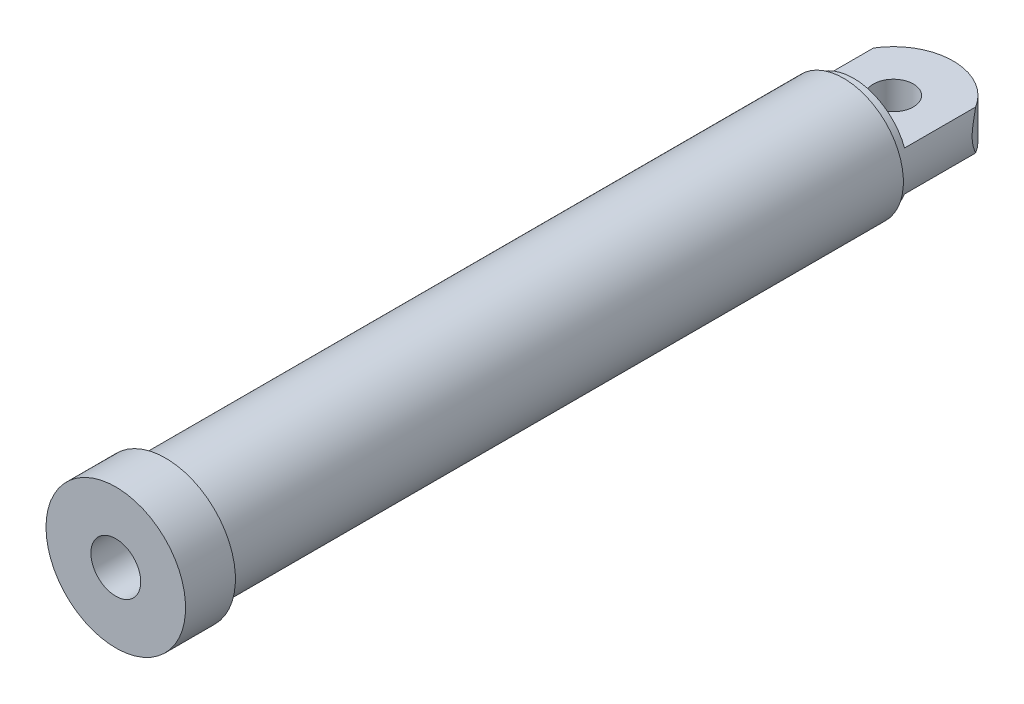
ISO-10303-21;
HEADER;
FILE_DESCRIPTION(('STEP AP214'),'2;1');
FILE_NAME('part.step','',(''),(''),'','','');
FILE_SCHEMA(('AUTOMOTIVE_DESIGN { 1 0 10303 214 1 1 1 1 }'));
ENDSEC;
DATA;
#1=APPLICATION_CONTEXT('core data for automotive mechanical design processes');
#2=APPLICATION_PROTOCOL_DEFINITION('international standard','automotive_design',2000,#1);
#3=PRODUCT_CONTEXT('',#1,'mechanical');
#4=PRODUCT('Part','Part','',(#3));
#5=PRODUCT_RELATED_PRODUCT_CATEGORY('part','',(#4));
#6=PRODUCT_DEFINITION_FORMATION('','',#4);
#7=PRODUCT_DEFINITION_CONTEXT('part definition',#1,'design');
#8=PRODUCT_DEFINITION('design','',#6,#7);
#9=PRODUCT_DEFINITION_SHAPE('','',#8);
#10=(LENGTH_UNIT() NAMED_UNIT(*) SI_UNIT(.MILLI.,.METRE.));
#11=(NAMED_UNIT(*) PLANE_ANGLE_UNIT() SI_UNIT($,.RADIAN.));
#12=(NAMED_UNIT(*) SI_UNIT($,.STERADIAN.) SOLID_ANGLE_UNIT());
#13=UNCERTAINTY_MEASURE_WITH_UNIT(LENGTH_MEASURE(1.E-05),#10,'distance_accuracy_value','');
#14=(GEOMETRIC_REPRESENTATION_CONTEXT(3) GLOBAL_UNCERTAINTY_ASSIGNED_CONTEXT((#13)) GLOBAL_UNIT_ASSIGNED_CONTEXT((#10,
#11,#12)) REPRESENTATION_CONTEXT('',''));
#15=CARTESIAN_POINT('',(0.,0.,0.));
#16=DIRECTION('',(0.,0.,1.));
#17=DIRECTION('',(1.,0.,0.));
#18=AXIS2_PLACEMENT_3D('',#15,#16,#17);
#19=CARTESIAN_POINT('',(0.,0.,0.));
#20=DIRECTION('',(0.,0.,-1.));
#21=DIRECTION('',(-1.,0.,0.));
#22=AXIS2_PLACEMENT_3D('',#19,#20,#21);
#23=CYLINDRICAL_SURFACE('',#22,60.);
#24=CARTESIAN_POINT('',(0.,0.,730.));
#25=DIRECTION('',(0.,0.,-1.));
#26=DIRECTION('',(-1.,0.,0.));
#27=AXIS2_PLACEMENT_3D('',#24,#25,#26);
#28=CIRCLE('',#27,60.);
#29=CARTESIAN_POINT('',(-59.9999999999999,0.,730.));
#30=VERTEX_POINT('',#29);
#31=EDGE_CURVE('E103',#30,#30,#28,.T.);
#32=ORIENTED_EDGE('',*,*,#31,.T.);
#33=EDGE_LOOP('',(#32));
#34=FACE_BOUND('',#33,.T.);
#35=CARTESIAN_POINT('',(0.,0.,50.));
#36=DIRECTION('',(0.,0.,-1.));
#37=DIRECTION('',(-1.,0.,0.));
#38=AXIS2_PLACEMENT_3D('',#35,#36,#37);
#39=CIRCLE('',#38,60.);
#40=CARTESIAN_POINT('',(-60.,0.,50.));
#41=VERTEX_POINT('',#40);
#42=EDGE_CURVE('E46',#41,#41,#39,.T.);
#43=ORIENTED_EDGE('',*,*,#42,.F.);
#44=EDGE_LOOP('',(#43));
#45=FACE_BOUND('',#44,.T.);
#46=ADVANCED_FACE('F43',(#34,#45),#23,.T.);
#47=CARTESIAN_POINT('',(45.0000000000001,0.,60.));
#48=DIRECTION('',(0.,0.,-1.));
#49=DIRECTION('',(-1.,0.,0.));
#50=AXIS2_PLACEMENT_3D('',#47,#48,#49);
#51=PLANE('',#50);
#52=CARTESIAN_POINT('',(0.,0.,60.));
#53=DIRECTION('',(0.,0.,-1.));
#54=DIRECTION('',(-1.,0.,0.));
#55=AXIS2_PLACEMENT_3D('',#52,#53,#54);
#56=CIRCLE('',#55,45.0000000000001);
#57=CARTESIAN_POINT('',(-45.0000000000001,0.,60.));
#58=VERTEX_POINT('',#57);
#59=EDGE_CURVE('E138',#58,#58,#56,.T.);
#60=ORIENTED_EDGE('',*,*,#59,.F.);
#61=EDGE_LOOP('',(#60));
#62=FACE_BOUND('',#61,.T.);
#63=ADVANCED_FACE('F180',(#62),#51,.F.);
#64=CARTESIAN_POINT('',(0.,0.,0.));
#65=DIRECTION('',(0.,0.,-1.));
#66=DIRECTION('',(-1.,0.,0.));
#67=AXIS2_PLACEMENT_3D('',#64,#65,#66);
#68=CYLINDRICAL_SURFACE('',#67,45.0000000000001);
#69=CARTESIAN_POINT('',(0.,0.,700.));
#70=DIRECTION('',(0.,0.,-1.));
#71=DIRECTION('',(-1.,0.,0.));
#72=AXIS2_PLACEMENT_3D('',#69,#70,#71);
#73=CIRCLE('',#72,45.);
#74=CARTESIAN_POINT('',(-45.,0.,700.));
#75=VERTEX_POINT('',#74);
#76=EDGE_CURVE('E134',#75,#75,#73,.T.);
#77=ORIENTED_EDGE('',*,*,#76,.F.);
#78=EDGE_LOOP('',(#77));
#79=FACE_BOUND('',#78,.T.);
#80=ORIENTED_EDGE('',*,*,#59,.T.);
#81=EDGE_LOOP('',(#80));
#82=FACE_BOUND('',#81,.T.);
#83=ADVANCED_FACE('F185',(#79,#82),#68,.F.);
#84=CARTESIAN_POINT('',(25.0000000000001,0.,700.));
#85=DIRECTION('',(0.,0.,1.));
#86=DIRECTION('',(1.,0.,0.));
#87=AXIS2_PLACEMENT_3D('',#84,#85,#86);
#88=PLANE('',#87);
#89=CARTESIAN_POINT('',(0.,0.,700.));
#90=DIRECTION('',(0.,0.,-1.));
#91=DIRECTION('',(-1.,0.,0.));
#92=AXIS2_PLACEMENT_3D('',#89,#90,#91);
#93=CIRCLE('',#92,25.);
#94=CARTESIAN_POINT('',(-25.,0.,700.));
#95=VERTEX_POINT('',#94);
#96=EDGE_CURVE('E130',#95,#95,#93,.T.);
#97=ORIENTED_EDGE('',*,*,#96,.F.);
#98=EDGE_LOOP('',(#97));
#99=FACE_BOUND('',#98,.T.);
#100=ORIENTED_EDGE('',*,*,#76,.T.);
#101=EDGE_LOOP('',(#100));
#102=FACE_BOUND('',#101,.T.);
#103=ADVANCED_FACE('F232',(#99,#102),#88,.F.);
#104=CARTESIAN_POINT('',(0.,0.,0.));
#105=DIRECTION('',(0.,0.,-1.));
#106=DIRECTION('',(-1.,0.,0.));
#107=AXIS2_PLACEMENT_3D('',#104,#105,#106);
#108=CYLINDRICAL_SURFACE('',#107,25.);
#109=CARTESIAN_POINT('',(0.,0.,780.));
#110=DIRECTION('',(0.,0.,-1.));
#111=DIRECTION('',(-1.,0.,0.));
#112=AXIS2_PLACEMENT_3D('',#109,#110,#111);
#113=CIRCLE('',#112,25.);
#114=CARTESIAN_POINT('',(-24.9999999999999,0.,780.));
#115=VERTEX_POINT('',#114);
#116=EDGE_CURVE('E126',#115,#115,#113,.T.);
#117=ORIENTED_EDGE('',*,*,#116,.F.);
#118=EDGE_LOOP('',(#117));
#119=FACE_BOUND('',#118,.T.);
#120=ORIENTED_EDGE('',*,*,#96,.T.);
#121=EDGE_LOOP('',(#120));
#122=FACE_BOUND('',#121,.T.);
#123=ADVANCED_FACE('F236',(#119,#122),#108,.F.);
#124=CARTESIAN_POINT('',(70.,0.,780.));
#125=DIRECTION('',(0.,0.,-1.));
#126=DIRECTION('',(-1.,0.,0.));
#127=AXIS2_PLACEMENT_3D('',#124,#125,#126);
#128=PLANE('',#127);
#129=CARTESIAN_POINT('',(0.,0.,780.));
#130=DIRECTION('',(0.,0.,-1.));
#131=DIRECTION('',(-1.,0.,0.));
#132=AXIS2_PLACEMENT_3D('',#129,#130,#131);
#133=CIRCLE('',#132,70.);
#134=CARTESIAN_POINT('',(-69.9999999999999,0.,780.));
#135=VERTEX_POINT('',#134);
#136=EDGE_CURVE('E122',#135,#135,#133,.T.);
#137=ORIENTED_EDGE('',*,*,#136,.F.);
#138=EDGE_LOOP('',(#137));
#139=FACE_BOUND('',#138,.T.);
#140=ORIENTED_EDGE('',*,*,#116,.T.);
#141=EDGE_LOOP('',(#140));
#142=FACE_BOUND('',#141,.T.);
#143=ADVANCED_FACE('F240',(#139,#142),#128,.F.);
#144=CARTESIAN_POINT('',(0.,0.,0.));
#145=DIRECTION('',(0.,0.,-1.));
#146=DIRECTION('',(-1.,0.,0.));
#147=AXIS2_PLACEMENT_3D('',#144,#145,#146);
#148=CYLINDRICAL_SURFACE('',#147,70.);
#149=CARTESIAN_POINT('',(0.,0.,730.));
#150=DIRECTION('',(0.,0.,-1.));
#151=DIRECTION('',(-1.,0.,0.));
#152=AXIS2_PLACEMENT_3D('',#149,#150,#151);
#153=CIRCLE('',#152,70.);
#154=CARTESIAN_POINT('',(-69.9999999999999,0.,730.));
#155=VERTEX_POINT('',#154);
#156=EDGE_CURVE('E109',#155,#155,#153,.T.);
#157=ORIENTED_EDGE('',*,*,#156,.F.);
#158=EDGE_LOOP('',(#157));
#159=FACE_BOUND('',#158,.T.);
#160=ORIENTED_EDGE('',*,*,#136,.T.);
#161=EDGE_LOOP('',(#160));
#162=FACE_BOUND('',#161,.T.);
#163=ADVANCED_FACE('F244',(#159,#162),#148,.T.);
#164=CARTESIAN_POINT('',(70.0000000000001,0.,730.));
#165=DIRECTION('',(0.,0.,1.));
#166=DIRECTION('',(1.,0.,0.));
#167=AXIS2_PLACEMENT_3D('',#164,#165,#166);
#168=PLANE('',#167);
#169=ORIENTED_EDGE('',*,*,#31,.F.);
#170=EDGE_LOOP('',(#169));
#171=FACE_BOUND('',#170,.T.);
#172=ORIENTED_EDGE('',*,*,#156,.T.);
#173=EDGE_LOOP('',(#172));
#174=FACE_BOUND('',#173,.T.);
#175=ADVANCED_FACE('F163',(#171,#174),#168,.F.);
#176=CARTESIAN_POINT('',(0.,0.,50.));
#177=DIRECTION('',(0.,0.,-1.));
#178=DIRECTION('',(-1.,0.,0.));
#179=AXIS2_PLACEMENT_3D('',#176,#177,#178);
#180=PLANE('',#179);
#181=CARTESIAN_POINT('',(0.,0.,50.));
#182=DIRECTION('',(0.,0.,-1.));
#183=DIRECTION('',(-1.,0.,0.));
#184=AXIS2_PLACEMENT_3D('',#181,#182,#183);
#185=CIRCLE('',#184,55.);
#186=CARTESIAN_POINT('',(-55.,0.,50.));
#187=VERTEX_POINT('',#186);
#188=EDGE_CURVE('E215',#187,#187,#185,.T.);
#189=ORIENTED_EDGE('',*,*,#188,.F.);
#190=EDGE_LOOP('',(#189));
#191=FACE_BOUND('',#190,.T.);
#192=ORIENTED_EDGE('',*,*,#42,.T.);
#193=EDGE_LOOP('',(#192));
#194=FACE_BOUND('',#193,.T.);
#195=ADVANCED_FACE('F158',(#191,#194),#180,.T.);
#196=CARTESIAN_POINT('',(0.,0.,50.));
#197=DIRECTION('',(0.,0.,-1.));
#198=DIRECTION('',(-1.,0.,0.));
#199=AXIS2_PLACEMENT_3D('',#196,#197,#198);
#200=CYLINDRICAL_SURFACE('',#199,55.);
#201=ORIENTED_EDGE('',*,*,#188,.T.);
#202=EDGE_LOOP('',(#201));
#203=FACE_BOUND('',#202,.T.);
#204=CARTESIAN_POINT('',(-51.234753829798,20.,-31.2249899919919));
#205=CARTESIAN_POINT('',(-51.3712103418228,19.6504237364978,-31.0010938328795));
#206=CARTESIAN_POINT('',(-51.5045010722681,19.2984175196761,-30.7790780288577));
#207=CARTESIAN_POINT('',(-51.7646776284598,18.5892682173008,-30.3394685057058));
#208=CARTESIAN_POINT('',(-51.8915628826439,18.2321246769833,-30.1218751822258));
#209=CARTESIAN_POINT('',(-52.2627851917116,17.1517340394822,-29.4762232921029));
#210=CARTESIAN_POINT('',(-52.4973346402981,16.4204317204274,-29.0558766833022));
#211=CARTESIAN_POINT('',(-52.9438002271502,14.9191174032238,-28.2343246571702));
#212=CARTESIAN_POINT('',(-53.1551453959298,14.148616962826,-27.8336977894913));
#213=CARTESIAN_POINT('',(-53.5476985578258,12.5815736915443,-27.0707928493247));
#214=CARTESIAN_POINT('',(-53.7289198957763,11.7850425803651,-26.7084978218561));
#215=CARTESIAN_POINT('',(-54.0320486449519,10.2964403032531,-26.0890146093488));
#216=CARTESIAN_POINT('',(-54.1588093516962,9.60850208399527,-25.824319564569));
#217=CARTESIAN_POINT('',(-54.3878807602413,8.21328418298736,-25.3383236994417));
#218=CARTESIAN_POINT('',(-54.4901915331757,7.50600455751513,-25.1170227528453));
#219=CARTESIAN_POINT('',(-54.6676594152826,6.079414602545,-24.728373986342));
#220=CARTESIAN_POINT('',(-54.7430277551137,5.36024628748654,-24.560607619583));
#221=CARTESIAN_POINT('',(-54.8658161359943,3.90805134142374,-24.2850814531454));
#222=CARTESIAN_POINT('',(-54.9132396611083,3.17502644977659,-24.1773141730769));
#223=CARTESIAN_POINT('',(-54.9790922993348,1.69071815352413,-24.0272020410826));
#224=CARTESIAN_POINT('',(-54.9971160006449,0.939322146177825,-23.9857720949582));
#225=CARTESIAN_POINT('',(-55.0022441114968,-0.564122307132695,-23.974010795699));
#226=CARTESIAN_POINT('',(-54.9893491524318,-1.31617073946016,-24.0036779906824));
#227=CARTESIAN_POINT('',(-54.933030345018,-2.81547449110806,-24.1322803420913));
#228=CARTESIAN_POINT('',(-54.8895092852759,-3.56270688150815,-24.2314360603559));
#229=CARTESIAN_POINT('',(-54.7732967602278,-5.04362627676651,-24.4929825623701));
#230=CARTESIAN_POINT('',(-54.7005991865704,-5.7773104115164,-24.6553865874797));
#231=CARTESIAN_POINT('',(-54.5055023316134,-7.41600648368185,-25.0842378146332));
#232=CARTESIAN_POINT('',(-54.3750869446152,-8.31582405094968,-25.366770913127));
#233=CARTESIAN_POINT('',(-54.0750770237305,-10.0842285671677,-26.0001633436826));
#234=CARTESIAN_POINT('',(-53.905463062673,-10.9527997826453,-26.3510565420488));
#235=CARTESIAN_POINT('',(-53.5300769735132,-12.6608560434831,-27.1055121659923));
#236=CARTESIAN_POINT('',(-53.3242218928405,-13.5002689540104,-27.5091948645809));
#237=CARTESIAN_POINT('',(-52.8792385885377,-15.1497743587683,-28.3551495939166));
#238=CARTESIAN_POINT('',(-52.6401204697679,-15.9598756636414,-28.7974098901525));
#239=CARTESIAN_POINT('',(-52.207951260875,-17.3109334351971,-29.5713066295323));
#240=CARTESIAN_POINT('',(-52.0230363606781,-17.8587485796701,-29.8956334935264));
#241=CARTESIAN_POINT('',(-51.639340122877,-18.9395084157563,-30.5536154642438));
#242=CARTESIAN_POINT('',(-51.4406371557238,-19.4725163514551,-30.8872122757043));
#243=CARTESIAN_POINT('',(-51.234753829798,-20.,-31.2249899919919));
#244=B_SPLINE_CURVE_WITH_KNOTS('',3,(#204,#205,#206,#207,#208,#209,#210,#211,#212,#213,#214,
#215,#216,#217,#218,#219,#220,#221,#222,#223,#224,#225,#226,#227,#228,#229,#230,#231,#232,#233,
#234,#235,#236,#237,#238,#239,#240,#241,#242,#243),.UNSPECIFIED.,.F.,.F.,(4,2,2,2,2,2,2,2,2,2,2,
2,2,2,2,2,2,2,2,4),(0.,1.31090200495055,2.62192077599482,5.24735611740963,7.92729682701593,
10.6060471425754,12.84821496436,15.0903762627869,17.3145520049003,19.5384503856338,
21.7927638622824,24.0470313037586,26.3084865603976,28.570415519115,31.4219764528141,
34.2749536884494,37.1345481013978,39.9932756977515,41.981735899764,43.9596969653085),.UNSPECIFIED.);
#245=CARTESIAN_POINT('',(-51.234753829798,20.,-31.2249899919919));
#246=VERTEX_POINT('',#245);
#247=CARTESIAN_POINT('',(-51.234753829798,-20.,-31.2249899919919));
#248=VERTEX_POINT('',#247);
#249=EDGE_CURVE('E11',#246,#248,#244,.T.);
#250=ORIENTED_EDGE('',*,*,#249,.T.);
#251=DIRECTION('',(0.,0.,-1.));
#252=VECTOR('',#251,1.);
#253=CARTESIAN_POINT('',(-51.234753829798,-20.,50.));
#254=LINE('',#253,#252);
#255=CARTESIAN_POINT('',(-51.234753829798,-20.,40.));
#256=VERTEX_POINT('',#255);
#257=EDGE_CURVE('E197',#248,#256,#254,.F.);
#258=ORIENTED_EDGE('',*,*,#257,.T.);
#259=CARTESIAN_POINT('',(0.,0.,40.));
#260=DIRECTION('',(0.,0.,1.));
#261=DIRECTION('',(1.,0.,0.));
#262=AXIS2_PLACEMENT_3D('',#259,#260,#261);
#263=CIRCLE('',#262,55.);
#264=CARTESIAN_POINT('',(51.234753829798,-20.,40.));
#265=VERTEX_POINT('',#264);
#266=EDGE_CURVE('E99',#256,#265,#263,.T.);
#267=ORIENTED_EDGE('',*,*,#266,.T.);
#268=DIRECTION('',(0.,0.,-1.));
#269=VECTOR('',#268,1.);
#270=CARTESIAN_POINT('',(51.234753829798,-20.,50.));
#271=LINE('',#270,#269);
#272=CARTESIAN_POINT('',(51.234753829798,-20.,-31.224989991992));
#273=VERTEX_POINT('',#272);
#274=EDGE_CURVE('E59',#265,#273,#271,.T.);
#275=ORIENTED_EDGE('',*,*,#274,.T.);
#276=CARTESIAN_POINT('',(51.234753829798,-20.,-31.224989991992));
#277=CARTESIAN_POINT('',(51.3712103418227,-19.6504237364978,-31.0010938328795));
#278=CARTESIAN_POINT('',(51.5045010722681,-19.2984175196761,-30.7790780288578));
#279=CARTESIAN_POINT('',(51.7646776284598,-18.5892682173008,-30.3394685057058));
#280=CARTESIAN_POINT('',(51.8915628826439,-18.2321246769833,-30.1218751822258));
#281=CARTESIAN_POINT('',(52.2627851917116,-17.1517340394822,-29.4762232921029));
#282=CARTESIAN_POINT('',(52.4973346402981,-16.4204317204274,-29.0558766833022));
#283=CARTESIAN_POINT('',(52.9438002271502,-14.9191174032238,-28.2343246571702));
#284=CARTESIAN_POINT('',(53.1551453959298,-14.148616962826,-27.8336977894913));
#285=CARTESIAN_POINT('',(53.5476985578258,-12.5815736915443,-27.0707928493247));
#286=CARTESIAN_POINT('',(53.7289198957763,-11.7850425803651,-26.7084978218561));
#287=CARTESIAN_POINT('',(54.0320486449519,-10.2964403032531,-26.0890146093488));
#288=CARTESIAN_POINT('',(54.1588093516962,-9.60850208399527,-25.824319564569));
#289=CARTESIAN_POINT('',(54.3878807602413,-8.21328418298737,-25.3383236994417));
#290=CARTESIAN_POINT('',(54.4901915331757,-7.50600455751514,-25.1170227528453));
#291=CARTESIAN_POINT('',(54.6676594152826,-6.07941460254501,-24.728373986342));
#292=CARTESIAN_POINT('',(54.7430277551137,-5.36024628748655,-24.560607619583));
#293=CARTESIAN_POINT('',(54.8658161359943,-3.90805134142375,-24.2850814531454));
#294=CARTESIAN_POINT('',(54.9132396611083,-3.1750264497766,-24.1773141730769));
#295=CARTESIAN_POINT('',(54.9790922993348,-1.69071815352414,-24.0272020410826));
#296=CARTESIAN_POINT('',(54.9971160006449,-0.939322146177828,-23.9857720949582));
#297=CARTESIAN_POINT('',(55.0022441114968,0.564122307132693,-23.974010795699));
#298=CARTESIAN_POINT('',(54.9893491524318,1.31617073946016,-24.0036779906824));
#299=CARTESIAN_POINT('',(54.933030345018,2.81547449110805,-24.1322803420913));
#300=CARTESIAN_POINT('',(54.8895092852759,3.56270688150814,-24.2314360603559));
#301=CARTESIAN_POINT('',(54.7732967602278,5.0436262767665,-24.4929825623701));
#302=CARTESIAN_POINT('',(54.7005991865704,5.7773104115164,-24.6553865874797));
#303=CARTESIAN_POINT('',(54.5055023316134,7.41600648368185,-25.0842378146331));
#304=CARTESIAN_POINT('',(54.3750869446152,8.31582405094967,-25.366770913127));
#305=CARTESIAN_POINT('',(54.0750770237305,10.0842285671677,-26.0001633436826));
#306=CARTESIAN_POINT('',(53.905463062673,10.9527997826453,-26.3510565420488));
#307=CARTESIAN_POINT('',(53.5300769735132,12.6608560434831,-27.1055121659923));
#308=CARTESIAN_POINT('',(53.3242218928405,13.5002689540104,-27.5091948645809));
#309=CARTESIAN_POINT('',(52.8792385885377,15.1497743587683,-28.3551495939166));
#310=CARTESIAN_POINT('',(52.6401204697679,15.9598756636414,-28.7974098901525));
#311=CARTESIAN_POINT('',(52.207951260875,17.3109334351971,-29.5713066295323));
#312=CARTESIAN_POINT('',(52.0230363606781,17.8587485796701,-29.8956334935264));
#313=CARTESIAN_POINT('',(51.639340122877,18.9395084157563,-30.5536154642438));
#314=CARTESIAN_POINT('',(51.4406371557238,19.4725163514551,-30.8872122757043));
#315=CARTESIAN_POINT('',(51.234753829798,20.,-31.2249899919919));
#316=B_SPLINE_CURVE_WITH_KNOTS('',3,(#276,#277,#278,#279,#280,#281,#282,#283,#284,#285,#286,
#287,#288,#289,#290,#291,#292,#293,#294,#295,#296,#297,#298,#299,#300,#301,#302,#303,#304,#305,
#306,#307,#308,#309,#310,#311,#312,#313,#314,#315),.UNSPECIFIED.,.F.,.F.,(4,2,2,2,2,2,2,2,2,2,2,
2,2,2,2,2,2,2,2,4),(0.,1.31090200495055,2.62192077599482,5.24735611740963,7.92729682701594,
10.6060471425754,12.84821496436,15.0903762627869,17.3145520049003,19.5384503856338,
21.7927638622824,24.0470313037586,26.3084865603976,28.570415519115,31.4219764528141,
34.2749536884494,37.1345481013978,39.9932756977515,41.9817358997641,43.9596969653085),.UNSPECIFIED.);
#317=CARTESIAN_POINT('',(51.234753829798,20.,-31.224989991992));
#318=VERTEX_POINT('',#317);
#319=EDGE_CURVE('E52',#273,#318,#316,.T.);
#320=ORIENTED_EDGE('',*,*,#319,.T.);
#321=DIRECTION('',(0.,0.,-1.));
#322=VECTOR('',#321,1.);
#323=CARTESIAN_POINT('',(51.234753829798,20.,50.));
#324=LINE('',#323,#322);
#325=CARTESIAN_POINT('',(51.234753829798,20.,40.));
#326=VERTEX_POINT('',#325);
#327=EDGE_CURVE('E82',#326,#318,#324,.T.);
#328=ORIENTED_EDGE('',*,*,#327,.F.);
#329=CARTESIAN_POINT('',(0.,0.,40.));
#330=DIRECTION('',(0.,0.,1.));
#331=DIRECTION('',(1.,0.,0.));
#332=AXIS2_PLACEMENT_3D('',#329,#330,#331);
#333=CIRCLE('',#332,55.);
#334=CARTESIAN_POINT('',(-51.234753829798,20.,40.));
#335=VERTEX_POINT('',#334);
#336=EDGE_CURVE('E200',#326,#335,#333,.T.);
#337=ORIENTED_EDGE('',*,*,#336,.T.);
#338=DIRECTION('',(0.,0.,-1.));
#339=VECTOR('',#338,1.);
#340=CARTESIAN_POINT('',(-51.234753829798,20.,50.));
#341=LINE('',#340,#339);
#342=EDGE_CURVE('E65',#246,#335,#341,.F.);
#343=ORIENTED_EDGE('',*,*,#342,.F.);
#344=EDGE_LOOP('',(#250,#258,#267,#275,#320,#328,#337,#343));
#345=FACE_BOUND('',#344,.T.);
#346=ADVANCED_FACE('F81',(#203,#345),#200,.T.);
#347=CARTESIAN_POINT('',(0.,20.,0.));
#348=DIRECTION('',(0.,-1.,0.));
#349=DIRECTION('',(0.,0.,-1.));
#350=AXIS2_PLACEMENT_3D('',#347,#348,#349);
#351=CYLINDRICAL_SURFACE('',#350,20.);
#352=CARTESIAN_POINT('',(0.,20.,0.));
#353=DIRECTION('',(0.,1.,0.));
#354=DIRECTION('',(0.,0.,1.));
#355=AXIS2_PLACEMENT_3D('',#352,#353,#354);
#356=CIRCLE('',#355,20.);
#357=CARTESIAN_POINT('',(0.,20.,20.));
#358=VERTEX_POINT('',#357);
#359=EDGE_CURVE('E111',#358,#358,#356,.T.);
#360=ORIENTED_EDGE('',*,*,#359,.T.);
#361=EDGE_LOOP('',(#360));
#362=FACE_BOUND('',#361,.T.);
#363=CARTESIAN_POINT('',(0.,-20.,0.));
#364=DIRECTION('',(0.,1.,0.));
#365=DIRECTION('',(0.,0.,1.));
#366=AXIS2_PLACEMENT_3D('',#363,#364,#365);
#367=CIRCLE('',#366,20.);
#368=CARTESIAN_POINT('',(0.,-20.,20.));
#369=VERTEX_POINT('',#368);
#370=EDGE_CURVE('E194',#369,#369,#367,.T.);
#371=ORIENTED_EDGE('',*,*,#370,.F.);
#372=EDGE_LOOP('',(#371));
#373=FACE_BOUND('',#372,.T.);
#374=ADVANCED_FACE('F157',(#362,#373),#351,.F.);
#375=CARTESIAN_POINT('',(0.,20.,0.));
#376=DIRECTION('',(0.,-1.,0.));
#377=DIRECTION('',(0.,0.,-1.));
#378=AXIS2_PLACEMENT_3D('',#375,#376,#377);
#379=CYLINDRICAL_SURFACE('',#378,60.);
#380=ORIENTED_EDGE('',*,*,#249,.F.);
#381=CARTESIAN_POINT('',(0.,20.,0.));
#382=DIRECTION('',(0.,1.,0.));
#383=DIRECTION('',(0.,0.,1.));
#384=AXIS2_PLACEMENT_3D('',#381,#382,#383);
#385=CIRCLE('',#384,60.);
#386=EDGE_CURVE('E95',#318,#246,#385,.T.);
#387=ORIENTED_EDGE('',*,*,#386,.F.);
#388=ORIENTED_EDGE('',*,*,#319,.F.);
#389=CARTESIAN_POINT('',(0.,-20.,0.));
#390=DIRECTION('',(0.,1.,0.));
#391=DIRECTION('',(0.,0.,1.));
#392=AXIS2_PLACEMENT_3D('',#389,#390,#391);
#393=CIRCLE('',#392,60.);
#394=EDGE_CURVE('E104',#273,#248,#393,.T.);
#395=ORIENTED_EDGE('',*,*,#394,.T.);
#396=EDGE_LOOP('',(#380,#387,#388,#395));
#397=FACE_BOUND('',#396,.T.);
#398=ADVANCED_FACE('F101',(#397),#379,.T.);
#399=CARTESIAN_POINT('',(0.,-20.,0.));
#400=DIRECTION('',(0.,1.,0.));
#401=DIRECTION('',(0.,0.,1.));
#402=AXIS2_PLACEMENT_3D('',#399,#400,#401);
#403=PLANE('',#402);
#404=ORIENTED_EDGE('',*,*,#370,.T.);
#405=EDGE_LOOP('',(#404));
#406=FACE_BOUND('',#405,.T.);
#407=ORIENTED_EDGE('',*,*,#274,.F.);
#408=DIRECTION('',(1.,0.,0.));
#409=VECTOR('',#408,1.);
#410=CARTESIAN_POINT('',(60.0000000000001,-20.,40.));
#411=LINE('',#410,#409);
#412=EDGE_CURVE('E89',#256,#265,#411,.T.);
#413=ORIENTED_EDGE('',*,*,#412,.F.);
#414=ORIENTED_EDGE('',*,*,#257,.F.);
#415=ORIENTED_EDGE('',*,*,#394,.F.);
#416=EDGE_LOOP('',(#407,#413,#414,#415));
#417=FACE_BOUND('',#416,.T.);
#418=ADVANCED_FACE('F170',(#406,#417),#403,.F.);
#419=CARTESIAN_POINT('',(0.,20.,0.));
#420=DIRECTION('',(0.,1.,0.));
#421=DIRECTION('',(0.,0.,1.));
#422=AXIS2_PLACEMENT_3D('',#419,#420,#421);
#423=PLANE('',#422);
#424=ORIENTED_EDGE('',*,*,#359,.F.);
#425=EDGE_LOOP('',(#424));
#426=FACE_BOUND('',#425,.T.);
#427=DIRECTION('',(1.,0.,0.));
#428=VECTOR('',#427,1.);
#429=CARTESIAN_POINT('',(60.0000000000001,20.,40.));
#430=LINE('',#429,#428);
#431=EDGE_CURVE('E97',#335,#326,#430,.T.);
#432=ORIENTED_EDGE('',*,*,#431,.T.);
#433=ORIENTED_EDGE('',*,*,#327,.T.);
#434=ORIENTED_EDGE('',*,*,#386,.T.);
#435=ORIENTED_EDGE('',*,*,#342,.T.);
#436=EDGE_LOOP('',(#432,#433,#434,#435));
#437=FACE_BOUND('',#436,.T.);
#438=ADVANCED_FACE('F94',(#426,#437),#423,.T.);
#439=CARTESIAN_POINT('',(60.0000000000001,0.,40.));
#440=DIRECTION('',(0.,0.,1.));
#441=DIRECTION('',(1.,0.,0.));
#442=AXIS2_PLACEMENT_3D('',#439,#440,#441);
#443=PLANE('',#442);
#444=ORIENTED_EDGE('',*,*,#266,.F.);
#445=ORIENTED_EDGE('',*,*,#412,.T.);
#446=EDGE_LOOP('',(#444,#445));
#447=FACE_BOUND('',#446,.T.);
#448=ADVANCED_FACE('F169',(#447),#443,.F.);
#449=ORIENTED_EDGE('',*,*,#336,.F.);
#450=ORIENTED_EDGE('',*,*,#431,.F.);
#451=EDGE_LOOP('',(#449,#450));
#452=FACE_BOUND('',#451,.T.);
#453=ADVANCED_FACE('F224',(#452),#443,.F.);
#454=CLOSED_SHELL('',(#46,#63,#83,#103,#123,#143,#163,#175,#195,#346,#374,#398,#418,#438,#448,#453));
#455=MANIFOLD_SOLID_BREP('B2',#454);
#456=ADVANCED_BREP_SHAPE_REPRESENTATION('',(#18,#455),#14);
#457=SHAPE_DEFINITION_REPRESENTATION(#9,#456);
ENDSEC;
END-ISO-10303-21;
